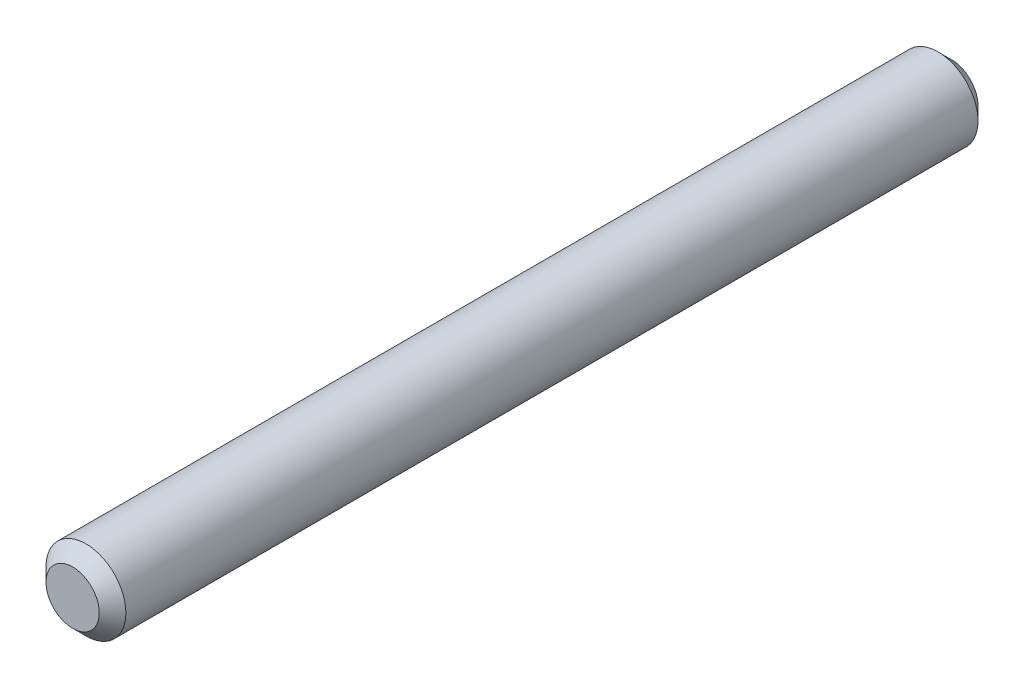
ISO-10303-21;
HEADER;
FILE_DESCRIPTION(('STEP AP214'),'2;1');
FILE_NAME('part.step','',(''),(''),'','','');
FILE_SCHEMA(('AUTOMOTIVE_DESIGN { 1 0 10303 214 1 1 1 1 }'));
ENDSEC;
DATA;
#1=APPLICATION_CONTEXT('core data for automotive mechanical design processes');
#2=APPLICATION_PROTOCOL_DEFINITION('international standard','automotive_design',2000,#1);
#3=PRODUCT_CONTEXT('',#1,'mechanical');
#4=PRODUCT('Part','Part','',(#3));
#5=PRODUCT_RELATED_PRODUCT_CATEGORY('part','',(#4));
#6=PRODUCT_DEFINITION_FORMATION('','',#4);
#7=PRODUCT_DEFINITION_CONTEXT('part definition',#1,'design');
#8=PRODUCT_DEFINITION('design','',#6,#7);
#9=PRODUCT_DEFINITION_SHAPE('','',#8);
#10=(LENGTH_UNIT() NAMED_UNIT(*) SI_UNIT(.MILLI.,.METRE.));
#11=(NAMED_UNIT(*) PLANE_ANGLE_UNIT() SI_UNIT($,.RADIAN.));
#12=(NAMED_UNIT(*) SI_UNIT($,.STERADIAN.) SOLID_ANGLE_UNIT());
#13=UNCERTAINTY_MEASURE_WITH_UNIT(LENGTH_MEASURE(1.E-05),#10,'distance_accuracy_value','');
#14=(GEOMETRIC_REPRESENTATION_CONTEXT(3) GLOBAL_UNCERTAINTY_ASSIGNED_CONTEXT((#13)) GLOBAL_UNIT_ASSIGNED_CONTEXT((#10,
#11,#12)) REPRESENTATION_CONTEXT('',''));
#15=CARTESIAN_POINT('',(0.,0.,0.));
#16=DIRECTION('',(0.,0.,1.));
#17=DIRECTION('',(1.,0.,0.));
#18=AXIS2_PLACEMENT_3D('',#15,#16,#17);
#19=CARTESIAN_POINT('',(0.,0.,33.));
#20=DIRECTION('',(0.,0.,-1.));
#21=DIRECTION('',(-1.,0.,0.));
#22=AXIS2_PLACEMENT_3D('',#19,#20,#21);
#23=CYLINDRICAL_SURFACE('',#22,3.);
#24=CARTESIAN_POINT('',(0.,0.,-32.));
#25=DIRECTION('',(0.,0.,1.));
#26=DIRECTION('',(1.,0.,0.));
#27=AXIS2_PLACEMENT_3D('',#24,#25,#26);
#28=CIRCLE('',#27,3.);
#29=CARTESIAN_POINT('',(3.,0.,-32.));
#30=VERTEX_POINT('',#29);
#31=EDGE_CURVE('E47',#30,#30,#28,.T.);
#32=ORIENTED_EDGE('',*,*,#31,.T.);
#33=EDGE_LOOP('',(#32));
#34=FACE_BOUND('',#33,.T.);
#35=CARTESIAN_POINT('',(0.,0.,32.));
#36=DIRECTION('',(0.,0.,1.));
#37=DIRECTION('',(1.,0.,0.));
#38=AXIS2_PLACEMENT_3D('',#35,#36,#37);
#39=CIRCLE('',#38,3.);
#40=CARTESIAN_POINT('',(3.,0.,32.));
#41=VERTEX_POINT('',#40);
#42=EDGE_CURVE('E52',#41,#41,#39,.F.);
#43=ORIENTED_EDGE('',*,*,#42,.T.);
#44=EDGE_LOOP('',(#43));
#45=FACE_BOUND('',#44,.T.);
#46=ADVANCED_FACE('F35',(#34,#45),#23,.T.);
#47=CARTESIAN_POINT('',(0.,0.,33.));
#48=DIRECTION('',(0.,0.,1.));
#49=DIRECTION('',(1.,0.,0.));
#50=AXIS2_PLACEMENT_3D('',#47,#48,#49);
#51=PLANE('',#50);
#52=CARTESIAN_POINT('',(0.,0.,33.));
#53=DIRECTION('',(0.,0.,1.));
#54=DIRECTION('',(1.,0.,0.));
#55=AXIS2_PLACEMENT_3D('',#52,#53,#54);
#56=CIRCLE('',#55,2.);
#57=CARTESIAN_POINT('',(2.,0.,33.));
#58=VERTEX_POINT('',#57);
#59=EDGE_CURVE('E10',#58,#58,#56,.T.);
#60=ORIENTED_EDGE('',*,*,#59,.T.);
#61=EDGE_LOOP('',(#60));
#62=FACE_BOUND('',#61,.T.);
#63=ADVANCED_FACE('F68',(#62),#51,.T.);
#64=CARTESIAN_POINT('',(0.,0.,-33.));
#65=DIRECTION('',(0.,0.,1.));
#66=DIRECTION('',(1.,0.,0.));
#67=AXIS2_PLACEMENT_3D('',#64,#65,#66);
#68=PLANE('',#67);
#69=CARTESIAN_POINT('',(0.,0.,-33.));
#70=DIRECTION('',(0.,0.,1.));
#71=DIRECTION('',(1.,0.,0.));
#72=AXIS2_PLACEMENT_3D('',#69,#70,#71);
#73=CIRCLE('',#72,2.);
#74=CARTESIAN_POINT('',(2.,0.,-33.));
#75=VERTEX_POINT('',#74);
#76=EDGE_CURVE('E42',#75,#75,#73,.F.);
#77=ORIENTED_EDGE('',*,*,#76,.T.);
#78=EDGE_LOOP('',(#77));
#79=FACE_BOUND('',#78,.T.);
#80=ADVANCED_FACE('F65',(#79),#68,.F.);
#81=CARTESIAN_POINT('',(0.,0.,-32.));
#82=DIRECTION('',(0.,0.,1.));
#83=DIRECTION('',(1.,0.,0.));
#84=AXIS2_PLACEMENT_3D('',#81,#82,#83);
#85=CONICAL_SURFACE('',#84,3.,0.785398163397454);
#86=ORIENTED_EDGE('',*,*,#76,.F.);
#87=EDGE_LOOP('',(#86));
#88=FACE_BOUND('',#87,.T.);
#89=ORIENTED_EDGE('',*,*,#31,.F.);
#90=EDGE_LOOP('',(#89));
#91=FACE_BOUND('',#90,.T.);
#92=ADVANCED_FACE('F61',(#88,#91),#85,.T.);
#93=CARTESIAN_POINT('',(0.,0.,33.));
#94=DIRECTION('',(0.,0.,-1.));
#95=DIRECTION('',(-1.,0.,0.));
#96=AXIS2_PLACEMENT_3D('',#93,#94,#95);
#97=CONICAL_SURFACE('',#96,2.,0.785398163397447);
#98=ORIENTED_EDGE('',*,*,#42,.F.);
#99=EDGE_LOOP('',(#98));
#100=FACE_BOUND('',#99,.T.);
#101=ORIENTED_EDGE('',*,*,#59,.F.);
#102=EDGE_LOOP('',(#101));
#103=FACE_BOUND('',#102,.T.);
#104=ADVANCED_FACE('F37',(#100,#103),#97,.T.);
#105=CLOSED_SHELL('',(#46,#63,#80,#92,#104));
#106=MANIFOLD_SOLID_BREP('B2',#105);
#107=ADVANCED_BREP_SHAPE_REPRESENTATION('',(#18,#106),#14);
#108=SHAPE_DEFINITION_REPRESENTATION(#9,#107);
ENDSEC;
END-ISO-10303-21;
